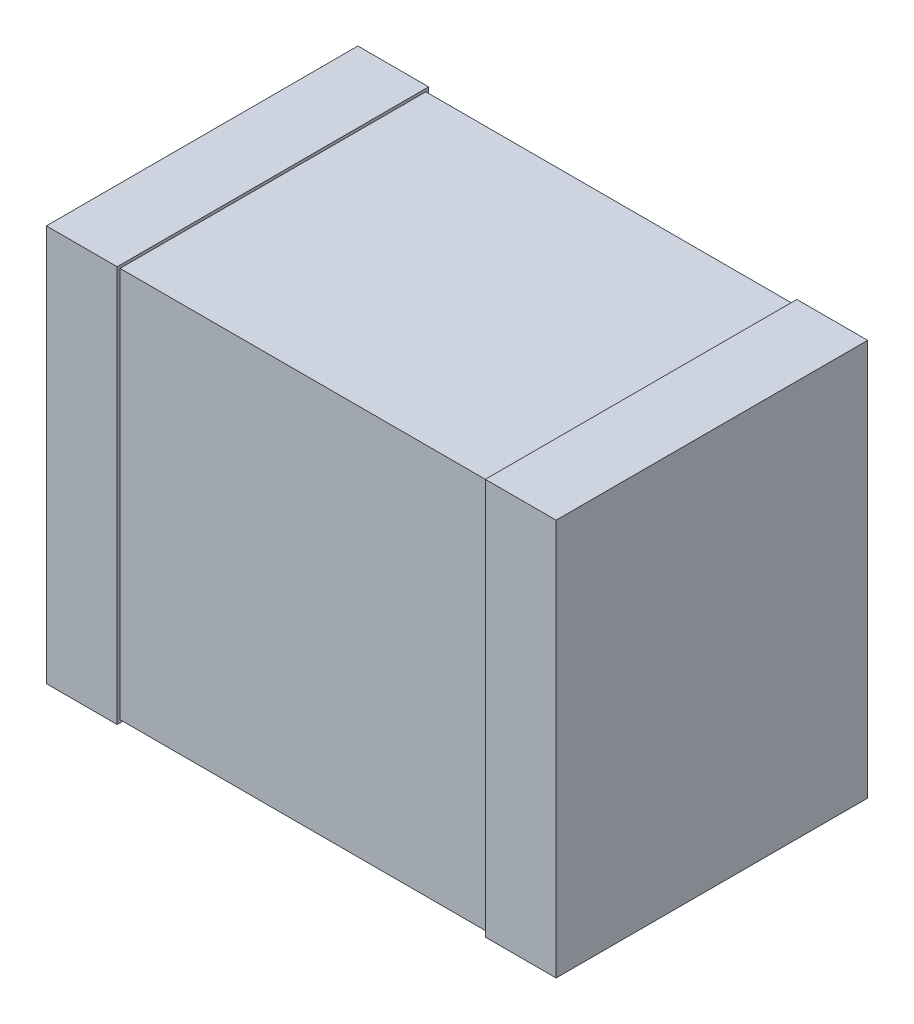
ISO-10303-21;
HEADER;
FILE_DESCRIPTION(('STEP AP214'),'2;1');
FILE_NAME('part.step','',(''),(''),'','','');
FILE_SCHEMA(('AUTOMOTIVE_DESIGN { 1 0 10303 214 1 1 1 1 }'));
ENDSEC;
DATA;
#1=APPLICATION_CONTEXT('core data for automotive mechanical design processes');
#2=APPLICATION_PROTOCOL_DEFINITION('international standard','automotive_design',2000,#1);
#3=PRODUCT_CONTEXT('',#1,'mechanical');
#4=PRODUCT('Part','Part','',(#3));
#5=PRODUCT_RELATED_PRODUCT_CATEGORY('part','',(#4));
#6=PRODUCT_DEFINITION_FORMATION('','',#4);
#7=PRODUCT_DEFINITION_CONTEXT('part definition',#1,'design');
#8=PRODUCT_DEFINITION('design','',#6,#7);
#9=PRODUCT_DEFINITION_SHAPE('','',#8);
#10=(LENGTH_UNIT() NAMED_UNIT(*) SI_UNIT(.MILLI.,.METRE.));
#11=(NAMED_UNIT(*) PLANE_ANGLE_UNIT() SI_UNIT($,.RADIAN.));
#12=(NAMED_UNIT(*) SI_UNIT($,.STERADIAN.) SOLID_ANGLE_UNIT());
#13=UNCERTAINTY_MEASURE_WITH_UNIT(LENGTH_MEASURE(1.E-05),#10,'distance_accuracy_value','');
#14=(GEOMETRIC_REPRESENTATION_CONTEXT(3) GLOBAL_UNCERTAINTY_ASSIGNED_CONTEXT((#13)) GLOBAL_UNIT_ASSIGNED_CONTEXT((#10,
#11,#12)) REPRESENTATION_CONTEXT('',''));
#15=CARTESIAN_POINT('',(0.,0.,0.));
#16=DIRECTION('',(0.,0.,1.));
#17=DIRECTION('',(1.,0.,0.));
#18=AXIS2_PLACEMENT_3D('',#15,#16,#17);
#19=CARTESIAN_POINT('',(-1.799999999946,1.4,291599.6139351));
#20=DIRECTION('',(-1.,0.,0.));
#21=DIRECTION('',(0.,0.,1.));
#22=AXIS2_PLACEMENT_3D('',#19,#20,#21);
#23=PLANE('',#22);
#24=DIRECTION('',(0.,0.,-1.));
#25=VECTOR('',#24,1.);
#26=CARTESIAN_POINT('',(-1.800000000003,1.4,9.83291388329E-12));
#27=LINE('',#26,#25);
#28=CARTESIAN_POINT('',(-1.8000000000031,1.4,2.20000000001605));
#29=VERTEX_POINT('',#28);
#30=CARTESIAN_POINT('',(-1.80000000000308,1.4,7.37468541246052E-12));
#31=VERTEX_POINT('',#30);
#32=EDGE_CURVE('E116',#29,#31,#27,.T.);
#33=ORIENTED_EDGE('',*,*,#32,.T.);
#34=DIRECTION('',(0.,1.,0.));
#35=VECTOR('',#34,1.);
#36=CARTESIAN_POINT('',(-1.80000000000291,1.4,9.83291388327604E-12));
#37=LINE('',#36,#35);
#38=CARTESIAN_POINT('',(-1.8000000000031,-1.4,7.37468541246401E-12));
#39=VERTEX_POINT('',#38);
#40=EDGE_CURVE('E103',#39,#31,#37,.T.);
#41=ORIENTED_EDGE('',*,*,#40,.F.);
#42=DIRECTION('',(0.,0.,-1.));
#43=VECTOR('',#42,1.);
#44=CARTESIAN_POINT('',(-1.800000000003,-1.4,9.83291388329E-12));
#45=LINE('',#44,#43);
#46=CARTESIAN_POINT('',(-1.8000000000031,-1.4,2.20000000001605));
#47=VERTEX_POINT('',#46);
#48=EDGE_CURVE('E20',#47,#39,#45,.T.);
#49=ORIENTED_EDGE('',*,*,#48,.F.);
#50=DIRECTION('',(0.,1.,0.));
#51=VECTOR('',#50,1.);
#52=CARTESIAN_POINT('',(-1.80000000000291,1.4,2.200000000016));
#53=LINE('',#52,#51);
#54=EDGE_CURVE('E131',#29,#47,#53,.F.);
#55=ORIENTED_EDGE('',*,*,#54,.F.);
#56=EDGE_LOOP('',(#33,#41,#49,#55));
#57=FACE_BOUND('',#56,.T.);
#58=ADVANCED_FACE('F17',(#57),#23,.T.);
#59=CARTESIAN_POINT('',(1.800000000003,1.4,291599.6139351));
#60=DIRECTION('',(1.,0.,0.));
#61=DIRECTION('',(0.,0.,-1.));
#62=AXIS2_PLACEMENT_3D('',#59,#60,#61);
#63=PLANE('',#62);
#64=DIRECTION('',(0.,0.,-1.));
#65=VECTOR('',#64,1.);
#66=CARTESIAN_POINT('',(1.800000000003,1.4,2.200000000016));
#67=LINE('',#66,#65);
#68=CARTESIAN_POINT('',(1.80000000000298,1.4,4.41417735698224E-12));
#69=VERTEX_POINT('',#68);
#70=CARTESIAN_POINT('',(1.80000000000296,1.4,2.20000000001605));
#71=VERTEX_POINT('',#70);
#72=EDGE_CURVE('E142',#69,#71,#67,.F.);
#73=ORIENTED_EDGE('',*,*,#72,.T.);
#74=DIRECTION('',(0.,1.,0.));
#75=VECTOR('',#74,1.);
#76=CARTESIAN_POINT('',(1.80000000000291,1.4,2.200000000016));
#77=LINE('',#76,#75);
#78=CARTESIAN_POINT('',(1.80000000000298,-1.4,2.20000000001605));
#79=VERTEX_POINT('',#78);
#80=EDGE_CURVE('E138',#79,#71,#77,.T.);
#81=ORIENTED_EDGE('',*,*,#80,.F.);
#82=DIRECTION('',(0.,0.,-1.));
#83=VECTOR('',#82,1.);
#84=CARTESIAN_POINT('',(1.800000000003,-1.4,2.200000000016));
#85=LINE('',#84,#83);
#86=CARTESIAN_POINT('',(1.80000000000298,-1.4,4.41417735698224E-12));
#87=VERTEX_POINT('',#86);
#88=EDGE_CURVE('E133',#87,#79,#85,.F.);
#89=ORIENTED_EDGE('',*,*,#88,.F.);
#90=DIRECTION('',(0.,1.,0.));
#91=VECTOR('',#90,1.);
#92=CARTESIAN_POINT('',(1.80000000000291,1.4,5.88574328168835E-12));
#93=LINE('',#92,#91);
#94=EDGE_CURVE('E151',#69,#87,#93,.F.);
#95=ORIENTED_EDGE('',*,*,#94,.F.);
#96=EDGE_LOOP('',(#73,#81,#89,#95));
#97=FACE_BOUND('',#96,.T.);
#98=ADVANCED_FACE('F272',(#97),#63,.T.);
#99=CARTESIAN_POINT('',(-1.800000000003,-1.4,9.83291388329E-12));
#100=DIRECTION('',(0.,-1.,0.));
#101=DIRECTION('',(0.,0.,-1.));
#102=AXIS2_PLACEMENT_3D('',#99,#100,#101);
#103=PLANE('',#102);
#104=DIRECTION('',(0.,0.,-1.));
#105=VECTOR('',#104,1.);
#106=CARTESIAN_POINT('',(-1.299999999958,-1.4,291599.6139351));
#107=LINE('',#106,#105);
#108=CARTESIAN_POINT('',(-1.30000000001505,-1.4,2.20000000001605));
#109=VERTEX_POINT('',#108);
#110=CARTESIAN_POINT('',(-1.30000000001505,-1.4,7.37454637607678E-12));
#111=VERTEX_POINT('',#110);
#112=EDGE_CURVE('E154',#109,#111,#107,.T.);
#113=ORIENTED_EDGE('',*,*,#112,.F.);
#114=DIRECTION('',(1.,0.,0.));
#115=VECTOR('',#114,1.);
#116=CARTESIAN_POINT('',(-400000.,-1.4,2.200000000016));
#117=LINE('',#116,#115);
#118=EDGE_CURVE('E112',#47,#109,#117,.T.);
#119=ORIENTED_EDGE('',*,*,#118,.F.);
#120=ORIENTED_EDGE('',*,*,#48,.T.);
#121=DIRECTION('',(-1.,0.,0.));
#122=VECTOR('',#121,1.);
#123=CARTESIAN_POINT('',(-400000.,-1.4,4.547473508865E-10));
#124=LINE('',#123,#122);
#125=EDGE_CURVE('E109',#111,#39,#124,.T.);
#126=ORIENTED_EDGE('',*,*,#125,.F.);
#127=EDGE_LOOP('',(#113,#119,#120,#126));
#128=FACE_BOUND('',#127,.T.);
#129=ADVANCED_FACE('F108',(#128),#103,.T.);
#130=CARTESIAN_POINT('',(-400000.,1.4,4.547473508865E-10));
#131=DIRECTION('',(0.,0.,-1.));
#132=DIRECTION('',(-1.,0.,0.));
#133=AXIS2_PLACEMENT_3D('',#130,#131,#132);
#134=PLANE('',#133);
#135=DIRECTION('',(1.,0.,0.));
#136=VECTOR('',#135,1.);
#137=CARTESIAN_POINT('',(-1.800000000003,1.4,9.83291388329E-12));
#138=LINE('',#137,#136);
#139=CARTESIAN_POINT('',(-1.30000000001499,1.4,7.37440733968606E-12));
#140=VERTEX_POINT('',#139);
#141=EDGE_CURVE('E118',#31,#140,#138,.T.);
#142=ORIENTED_EDGE('',*,*,#141,.T.);
#143=DIRECTION('',(0.,1.,0.));
#144=VECTOR('',#143,1.);
#145=CARTESIAN_POINT('',(-1.30000000001548,1.4,0.));
#146=LINE('',#145,#144);
#147=EDGE_CURVE('E122',#111,#140,#146,.T.);
#148=ORIENTED_EDGE('',*,*,#147,.F.);
#149=ORIENTED_EDGE('',*,*,#125,.T.);
#150=ORIENTED_EDGE('',*,*,#40,.T.);
#151=EDGE_LOOP('',(#142,#148,#149,#150));
#152=FACE_BOUND('',#151,.T.);
#153=ADVANCED_FACE('F120',(#152),#134,.T.);
#154=CARTESIAN_POINT('',(-1.800000000003,1.4,9.83291388329E-12));
#155=DIRECTION('',(0.,-1.,0.));
#156=DIRECTION('',(0.,0.,-1.));
#157=AXIS2_PLACEMENT_3D('',#154,#155,#156);
#158=PLANE('',#157);
#159=DIRECTION('',(1.,0.,0.));
#160=VECTOR('',#159,1.);
#161=CARTESIAN_POINT('',(-400000.,1.4,2.200000000016));
#162=LINE('',#161,#160);
#163=CARTESIAN_POINT('',(-1.30000000001505,1.4,2.20000000001605));
#164=VERTEX_POINT('',#163);
#165=EDGE_CURVE('E128',#164,#29,#162,.F.);
#166=ORIENTED_EDGE('',*,*,#165,.F.);
#167=DIRECTION('',(0.,0.,-1.));
#168=VECTOR('',#167,1.);
#169=CARTESIAN_POINT('',(-1.299999999958,1.4,291599.6139351));
#170=LINE('',#169,#168);
#171=EDGE_CURVE('E157',#140,#164,#170,.F.);
#172=ORIENTED_EDGE('',*,*,#171,.F.);
#173=ORIENTED_EDGE('',*,*,#141,.F.);
#174=ORIENTED_EDGE('',*,*,#32,.F.);
#175=EDGE_LOOP('',(#166,#172,#173,#174));
#176=FACE_BOUND('',#175,.T.);
#177=ADVANCED_FACE('F224',(#176),#158,.F.);
#178=CARTESIAN_POINT('',(-400000.,1.4,2.200000000016));
#179=DIRECTION('',(0.,0.,1.));
#180=DIRECTION('',(1.,0.,0.));
#181=AXIS2_PLACEMENT_3D('',#178,#179,#180);
#182=PLANE('',#181);
#183=ORIENTED_EDGE('',*,*,#165,.T.);
#184=ORIENTED_EDGE('',*,*,#54,.T.);
#185=ORIENTED_EDGE('',*,*,#118,.T.);
#186=DIRECTION('',(0.,1.,0.));
#187=VECTOR('',#186,1.);
#188=CARTESIAN_POINT('',(-1.30000000001548,1.4,2.20000000001619));
#189=LINE('',#188,#187);
#190=EDGE_CURVE('E160',#164,#109,#189,.F.);
#191=ORIENTED_EDGE('',*,*,#190,.F.);
#192=EDGE_LOOP('',(#183,#184,#185,#191));
#193=FACE_BOUND('',#192,.T.);
#194=ADVANCED_FACE('F226',(#193),#182,.T.);
#195=CARTESIAN_POINT('',(1.800000000003,-1.4,2.200000000016));
#196=DIRECTION('',(0.,-1.,0.));
#197=DIRECTION('',(0.,0.,-1.));
#198=AXIS2_PLACEMENT_3D('',#195,#196,#197);
#199=PLANE('',#198);
#200=DIRECTION('',(0.,0.,1.));
#201=VECTOR('',#200,1.);
#202=CARTESIAN_POINT('',(1.300000000015,-1.4,291599.6139351));
#203=LINE('',#202,#201);
#204=CARTESIAN_POINT('',(1.30000000001493,-1.4,4.41406893676499E-12));
#205=VERTEX_POINT('',#204);
#206=CARTESIAN_POINT('',(1.30000000001493,-1.4,2.20000000001605));
#207=VERTEX_POINT('',#206);
#208=EDGE_CURVE('E170',#205,#207,#203,.T.);
#209=ORIENTED_EDGE('',*,*,#208,.F.);
#210=DIRECTION('',(-1.,0.,0.));
#211=VECTOR('',#210,1.);
#212=CARTESIAN_POINT('',(-400000.,-1.4,-3.410605131648E-10));
#213=LINE('',#212,#211);
#214=EDGE_CURVE('E145',#87,#205,#213,.T.);
#215=ORIENTED_EDGE('',*,*,#214,.F.);
#216=ORIENTED_EDGE('',*,*,#88,.T.);
#217=DIRECTION('',(1.,0.,0.));
#218=VECTOR('',#217,1.);
#219=CARTESIAN_POINT('',(-400000.,-1.4,2.200000000016));
#220=LINE('',#219,#218);
#221=EDGE_CURVE('E135',#207,#79,#220,.T.);
#222=ORIENTED_EDGE('',*,*,#221,.F.);
#223=EDGE_LOOP('',(#209,#215,#216,#222));
#224=FACE_BOUND('',#223,.T.);
#225=ADVANCED_FACE('F228',(#224),#199,.T.);
#226=CARTESIAN_POINT('',(-400000.,1.4,2.200000000016));
#227=DIRECTION('',(0.,0.,1.));
#228=DIRECTION('',(1.,0.,0.));
#229=AXIS2_PLACEMENT_3D('',#226,#227,#228);
#230=PLANE('',#229);
#231=DIRECTION('',(1.,0.,0.));
#232=VECTOR('',#231,1.);
#233=CARTESIAN_POINT('',(1.800000000003,1.4,2.200000000016));
#234=LINE('',#233,#232);
#235=CARTESIAN_POINT('',(1.30000000001487,1.4,2.20000000001605));
#236=VERTEX_POINT('',#235);
#237=EDGE_CURVE('E140',#71,#236,#234,.F.);
#238=ORIENTED_EDGE('',*,*,#237,.T.);
#239=DIRECTION('',(0.,1.,0.));
#240=VECTOR('',#239,1.);
#241=CARTESIAN_POINT('',(1.300000000015,1.4,2.20000000001619));
#242=LINE('',#241,#240);
#243=EDGE_CURVE('E173',#207,#236,#242,.T.);
#244=ORIENTED_EDGE('',*,*,#243,.F.);
#245=ORIENTED_EDGE('',*,*,#221,.T.);
#246=ORIENTED_EDGE('',*,*,#80,.T.);
#247=EDGE_LOOP('',(#238,#244,#245,#246));
#248=FACE_BOUND('',#247,.T.);
#249=ADVANCED_FACE('F235',(#248),#230,.T.);
#250=CARTESIAN_POINT('',(1.800000000003,1.4,2.200000000016));
#251=DIRECTION('',(0.,-1.,0.));
#252=DIRECTION('',(0.,0.,-1.));
#253=AXIS2_PLACEMENT_3D('',#250,#251,#252);
#254=PLANE('',#253);
#255=DIRECTION('',(-1.,0.,0.));
#256=VECTOR('',#255,1.);
#257=CARTESIAN_POINT('',(-400000.,1.4,-3.410605131648E-10));
#258=LINE('',#257,#256);
#259=CARTESIAN_POINT('',(1.30000000001493,1.4,4.41406893676499E-12));
#260=VERTEX_POINT('',#259);
#261=EDGE_CURVE('E148',#260,#69,#258,.F.);
#262=ORIENTED_EDGE('',*,*,#261,.F.);
#263=DIRECTION('',(0.,0.,1.));
#264=VECTOR('',#263,1.);
#265=CARTESIAN_POINT('',(1.300000000015,1.4,291599.6139351));
#266=LINE('',#265,#264);
#267=EDGE_CURVE('E176',#236,#260,#266,.F.);
#268=ORIENTED_EDGE('',*,*,#267,.F.);
#269=ORIENTED_EDGE('',*,*,#237,.F.);
#270=ORIENTED_EDGE('',*,*,#72,.F.);
#271=EDGE_LOOP('',(#262,#268,#269,#270));
#272=FACE_BOUND('',#271,.T.);
#273=ADVANCED_FACE('F255',(#272),#254,.F.);
#274=CARTESIAN_POINT('',(-400000.,1.4,-3.410605131648E-10));
#275=DIRECTION('',(0.,0.,-1.));
#276=DIRECTION('',(-1.,0.,0.));
#277=AXIS2_PLACEMENT_3D('',#274,#275,#276);
#278=PLANE('',#277);
#279=ORIENTED_EDGE('',*,*,#261,.T.);
#280=ORIENTED_EDGE('',*,*,#94,.T.);
#281=ORIENTED_EDGE('',*,*,#214,.T.);
#282=DIRECTION('',(0.,1.,0.));
#283=VECTOR('',#282,1.);
#284=CARTESIAN_POINT('',(1.300000000015,1.4,0.));
#285=LINE('',#284,#283);
#286=EDGE_CURVE('E179',#260,#205,#285,.F.);
#287=ORIENTED_EDGE('',*,*,#286,.F.);
#288=EDGE_LOOP('',(#279,#280,#281,#287));
#289=FACE_BOUND('',#288,.T.);
#290=ADVANCED_FACE('F252',(#289),#278,.T.);
#291=CARTESIAN_POINT('',(-400000.,1.38,0.02000000000635));
#292=DIRECTION('',(0.,0.,-1.));
#293=DIRECTION('',(-1.,0.,0.));
#294=AXIS2_PLACEMENT_3D('',#291,#292,#293);
#295=PLANE('',#294);
#296=DIRECTION('',(0.,1.,0.));
#297=VECTOR('',#296,1.);
#298=CARTESIAN_POINT('',(1.300000000015,1.4,0.0200000000063483));
#299=LINE('',#298,#297);
#300=CARTESIAN_POINT('',(1.30000000001493,-1.38,0.0200000000063496));
#301=VERTEX_POINT('',#300);
#302=CARTESIAN_POINT('',(1.30000000001493,1.38,0.0200000000063491));
#303=VERTEX_POINT('',#302);
#304=EDGE_CURVE('E185',#301,#303,#299,.T.);
#305=ORIENTED_EDGE('',*,*,#304,.F.);
#306=DIRECTION('',(1.,0.,0.));
#307=VECTOR('',#306,1.);
#308=CARTESIAN_POINT('',(-1.750000000015,-1.38,0.02000000000635));
#309=LINE('',#308,#307);
#310=CARTESIAN_POINT('',(-1.30000000001517,-1.38,0.0200000000063491));
#311=VERTEX_POINT('',#310);
#312=EDGE_CURVE('E168',#311,#301,#309,.T.);
#313=ORIENTED_EDGE('',*,*,#312,.F.);
#314=DIRECTION('',(0.,1.,0.));
#315=VECTOR('',#314,1.);
#316=CARTESIAN_POINT('',(-1.30000000001548,1.4,0.0200000000063483));
#317=LINE('',#316,#315);
#318=CARTESIAN_POINT('',(-1.30000000001517,1.38,0.0200000000063491));
#319=VERTEX_POINT('',#318);
#320=EDGE_CURVE('E163',#319,#311,#317,.F.);
#321=ORIENTED_EDGE('',*,*,#320,.F.);
#322=DIRECTION('',(1.,0.,0.));
#323=VECTOR('',#322,1.);
#324=CARTESIAN_POINT('',(-1.750000000015,1.38,0.02000000000635));
#325=LINE('',#324,#323);
#326=EDGE_CURVE('E191',#319,#303,#325,.T.);
#327=ORIENTED_EDGE('',*,*,#326,.T.);
#328=EDGE_LOOP('',(#305,#313,#321,#327));
#329=FACE_BOUND('',#328,.T.);
#330=ADVANCED_FACE('F211',(#329),#295,.T.);
#331=CARTESIAN_POINT('',(-1.299999999958,1.4,291599.6139351));
#332=DIRECTION('',(1.,0.,0.));
#333=DIRECTION('',(0.,0.,-1.));
#334=AXIS2_PLACEMENT_3D('',#331,#332,#333);
#335=PLANE('',#334);
#336=DIRECTION('',(0.,0.,-1.));
#337=VECTOR('',#336,1.);
#338=CARTESIAN_POINT('',(-1.300000000015,-1.38,2.18000000001));
#339=LINE('',#338,#337);
#340=CARTESIAN_POINT('',(-1.30000000001517,-1.38,2.18000000000992));
#341=VERTEX_POINT('',#340);
#342=EDGE_CURVE('E165',#341,#311,#339,.T.);
#343=ORIENTED_EDGE('',*,*,#342,.F.);
#344=DIRECTION('',(0.,1.,0.));
#345=VECTOR('',#344,1.);
#346=CARTESIAN_POINT('',(-1.30000000001473,1.38,2.18000000001));
#347=LINE('',#346,#345);
#348=CARTESIAN_POINT('',(-1.30000000001517,1.38,2.18000000000992));
#349=VERTEX_POINT('',#348);
#350=EDGE_CURVE('E194',#349,#341,#347,.F.);
#351=ORIENTED_EDGE('',*,*,#350,.F.);
#352=DIRECTION('',(0.,0.,-1.));
#353=VECTOR('',#352,1.);
#354=CARTESIAN_POINT('',(-1.300000000015,1.38,2.18000000001));
#355=LINE('',#354,#353);
#356=EDGE_CURVE('E188',#349,#319,#355,.T.);
#357=ORIENTED_EDGE('',*,*,#356,.T.);
#358=ORIENTED_EDGE('',*,*,#320,.T.);
#359=EDGE_LOOP('',(#343,#351,#357,#358));
#360=FACE_BOUND('',#359,.T.);
#361=ORIENTED_EDGE('',*,*,#171,.T.);
#362=ORIENTED_EDGE('',*,*,#190,.T.);
#363=ORIENTED_EDGE('',*,*,#112,.T.);
#364=ORIENTED_EDGE('',*,*,#147,.T.);
#365=EDGE_LOOP('',(#361,#362,#363,#364));
#366=FACE_BOUND('',#365,.T.);
#367=ADVANCED_FACE('F217',(#360,#366),#335,.T.);
#368=CARTESIAN_POINT('',(-1.750000000015,-1.38,2.18000000001));
#369=DIRECTION('',(0.,-1.,0.));
#370=DIRECTION('',(0.,0.,-1.));
#371=AXIS2_PLACEMENT_3D('',#368,#369,#370);
#372=PLANE('',#371);
#373=DIRECTION('',(0.,0.,1.));
#374=VECTOR('',#373,1.);
#375=CARTESIAN_POINT('',(1.300000000015,-1.38,291599.6139351));
#376=LINE('',#375,#374);
#377=CARTESIAN_POINT('',(1.30000000001493,-1.38,2.18000000000996));
#378=VERTEX_POINT('',#377);
#379=EDGE_CURVE('E182',#378,#301,#376,.F.);
#380=ORIENTED_EDGE('',*,*,#379,.F.);
#381=DIRECTION('',(1.,0.,0.));
#382=VECTOR('',#381,1.);
#383=CARTESIAN_POINT('',(-400000.,-1.38,2.18000000001));
#384=LINE('',#383,#382);
#385=EDGE_CURVE('E197',#341,#378,#384,.T.);
#386=ORIENTED_EDGE('',*,*,#385,.F.);
#387=ORIENTED_EDGE('',*,*,#342,.T.);
#388=ORIENTED_EDGE('',*,*,#312,.T.);
#389=EDGE_LOOP('',(#380,#386,#387,#388));
#390=FACE_BOUND('',#389,.T.);
#391=ADVANCED_FACE('F208',(#390),#372,.T.);
#392=CARTESIAN_POINT('',(1.300000000015,1.4,291599.6139351));
#393=DIRECTION('',(-1.,0.,0.));
#394=DIRECTION('',(0.,0.,1.));
#395=AXIS2_PLACEMENT_3D('',#392,#393,#394);
#396=PLANE('',#395);
#397=ORIENTED_EDGE('',*,*,#379,.T.);
#398=ORIENTED_EDGE('',*,*,#304,.T.);
#399=DIRECTION('',(0.,0.,-1.));
#400=VECTOR('',#399,1.);
#401=CARTESIAN_POINT('',(1.300000000015,1.38,2.18000000001));
#402=LINE('',#401,#400);
#403=CARTESIAN_POINT('',(1.30000000001493,1.38,2.18000000000992));
#404=VERTEX_POINT('',#403);
#405=EDGE_CURVE('E35',#303,#404,#402,.F.);
#406=ORIENTED_EDGE('',*,*,#405,.T.);
#407=DIRECTION('',(0.,1.,0.));
#408=VECTOR('',#407,1.);
#409=CARTESIAN_POINT('',(1.30000000001473,1.38,2.18000000001));
#410=LINE('',#409,#408);
#411=EDGE_CURVE('E26',#378,#404,#410,.T.);
#412=ORIENTED_EDGE('',*,*,#411,.F.);
#413=EDGE_LOOP('',(#397,#398,#406,#412));
#414=FACE_BOUND('',#413,.T.);
#415=ORIENTED_EDGE('',*,*,#267,.T.);
#416=ORIENTED_EDGE('',*,*,#286,.T.);
#417=ORIENTED_EDGE('',*,*,#208,.T.);
#418=ORIENTED_EDGE('',*,*,#243,.T.);
#419=EDGE_LOOP('',(#415,#416,#417,#418));
#420=FACE_BOUND('',#419,.T.);
#421=ADVANCED_FACE('F204',(#414,#420),#396,.T.);
#422=CARTESIAN_POINT('',(-1.750000000015,1.38,2.18000000001));
#423=DIRECTION('',(0.,-1.,0.));
#424=DIRECTION('',(0.,0.,-1.));
#425=AXIS2_PLACEMENT_3D('',#422,#423,#424);
#426=PLANE('',#425);
#427=ORIENTED_EDGE('',*,*,#356,.F.);
#428=DIRECTION('',(1.,0.,0.));
#429=VECTOR('',#428,1.);
#430=CARTESIAN_POINT('',(-400000.,1.38,2.18000000001));
#431=LINE('',#430,#429);
#432=EDGE_CURVE('E11',#404,#349,#431,.F.);
#433=ORIENTED_EDGE('',*,*,#432,.F.);
#434=ORIENTED_EDGE('',*,*,#405,.F.);
#435=ORIENTED_EDGE('',*,*,#326,.F.);
#436=EDGE_LOOP('',(#427,#433,#434,#435));
#437=FACE_BOUND('',#436,.T.);
#438=ADVANCED_FACE('F215',(#437),#426,.F.);
#439=CARTESIAN_POINT('',(-400000.,1.38,2.18000000001));
#440=DIRECTION('',(0.,0.,1.));
#441=DIRECTION('',(1.,0.,0.));
#442=AXIS2_PLACEMENT_3D('',#439,#440,#441);
#443=PLANE('',#442);
#444=ORIENTED_EDGE('',*,*,#411,.T.);
#445=ORIENTED_EDGE('',*,*,#432,.T.);
#446=ORIENTED_EDGE('',*,*,#350,.T.);
#447=ORIENTED_EDGE('',*,*,#385,.T.);
#448=EDGE_LOOP('',(#444,#445,#446,#447));
#449=FACE_BOUND('',#448,.T.);
#450=ADVANCED_FACE('F202',(#449),#443,.T.);
#451=CLOSED_SHELL('',(#58,#98,#129,#153,#177,#194,#225,#249,#273,#290,#330,#367,#391,#421,#438,#450));
#452=MANIFOLD_SOLID_BREP('B1',#451);
#453=ADVANCED_BREP_SHAPE_REPRESENTATION('',(#18,#452),#14);
#454=SHAPE_DEFINITION_REPRESENTATION(#9,#453);
ENDSEC;
END-ISO-10303-21;
